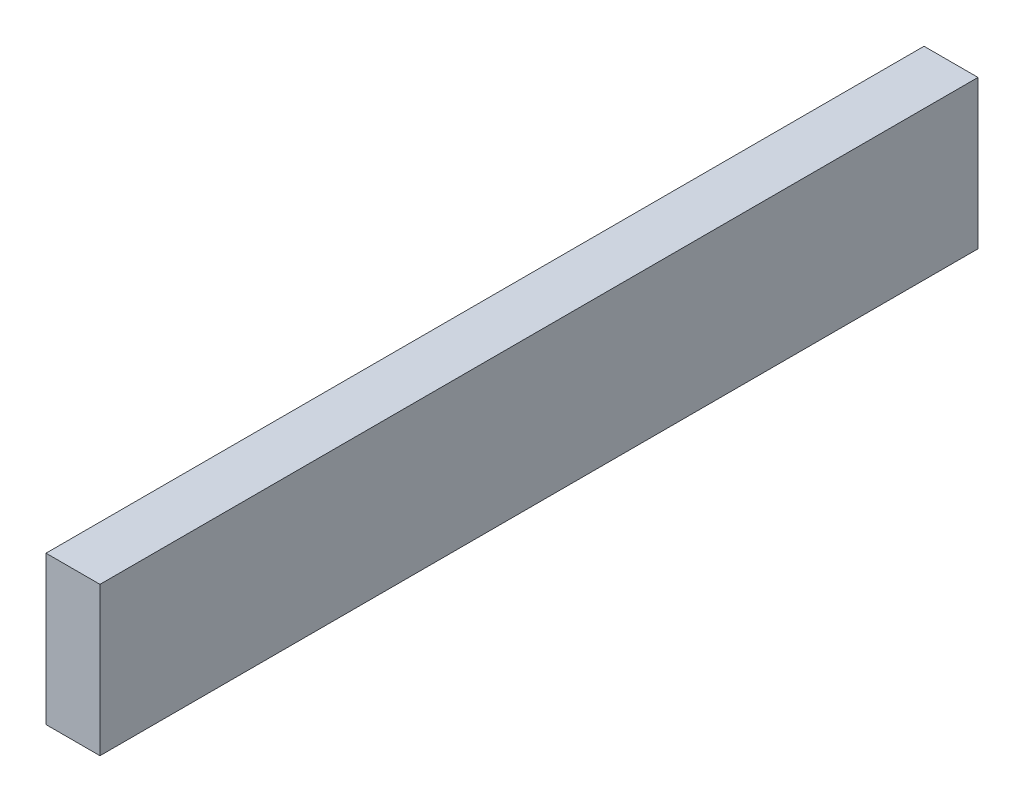
ISO-10303-21;
HEADER;
FILE_DESCRIPTION(('STEP AP214'),'2;1');
FILE_NAME('part.step','',(''),(''),'','','');
FILE_SCHEMA(('AUTOMOTIVE_DESIGN { 1 0 10303 214 1 1 1 1 }'));
ENDSEC;
DATA;
#1=APPLICATION_CONTEXT('core data for automotive mechanical design processes');
#2=APPLICATION_PROTOCOL_DEFINITION('international standard','automotive_design',2000,#1);
#3=PRODUCT_CONTEXT('',#1,'mechanical');
#4=PRODUCT('Part','Part','',(#3));
#5=PRODUCT_RELATED_PRODUCT_CATEGORY('part','',(#4));
#6=PRODUCT_DEFINITION_FORMATION('','',#4);
#7=PRODUCT_DEFINITION_CONTEXT('part definition',#1,'design');
#8=PRODUCT_DEFINITION('design','',#6,#7);
#9=PRODUCT_DEFINITION_SHAPE('','',#8);
#10=(LENGTH_UNIT() NAMED_UNIT(*) SI_UNIT(.MILLI.,.METRE.));
#11=(NAMED_UNIT(*) PLANE_ANGLE_UNIT() SI_UNIT($,.RADIAN.));
#12=(NAMED_UNIT(*) SI_UNIT($,.STERADIAN.) SOLID_ANGLE_UNIT());
#13=UNCERTAINTY_MEASURE_WITH_UNIT(LENGTH_MEASURE(1.E-05),#10,'distance_accuracy_value','');
#14=(GEOMETRIC_REPRESENTATION_CONTEXT(3) GLOBAL_UNCERTAINTY_ASSIGNED_CONTEXT((#13)) GLOBAL_UNIT_ASSIGNED_CONTEXT((#10,
#11,#12)) REPRESENTATION_CONTEXT('',''));
#15=CARTESIAN_POINT('',(0.,0.,0.));
#16=DIRECTION('',(0.,0.,1.));
#17=DIRECTION('',(1.,0.,0.));
#18=AXIS2_PLACEMENT_3D('',#15,#16,#17);
#19=CARTESIAN_POINT('',(1.4254546527396,0.0173250408436242,0.));
#20=DIRECTION('',(0.,-1.,0.));
#21=DIRECTION('',(1.,0.,0.));
#22=AXIS2_PLACEMENT_3D('',#19,#20,#21);
#23=PLANE('',#22);
#24=DIRECTION('',(1.,0.,0.));
#25=VECTOR('',#24,1.);
#26=CARTESIAN_POINT('',(1.4254546527396,0.0173250408436242,0.));
#27=LINE('',#26,#25);
#28=CARTESIAN_POINT('',(1.4254546527396,0.0173250408436242,0.));
#29=VERTEX_POINT('',#28);
#30=CARTESIAN_POINT('',(1.4316017000509,0.0173250408436242,0.));
#31=VERTEX_POINT('',#30);
#32=EDGE_CURVE('E11',#29,#31,#27,.T.);
#33=ORIENTED_EDGE('',*,*,#32,.T.);
#34=DIRECTION('',(0.,0.,1.));
#35=VECTOR('',#34,1.);
#36=CARTESIAN_POINT('',(1.4316017000509,0.0173250408436242,0.));
#37=LINE('',#36,#35);
#38=CARTESIAN_POINT('',(1.4316017000509,0.0173250408436242,0.1));
#39=VERTEX_POINT('',#38);
#40=EDGE_CURVE('E24',#31,#39,#37,.T.);
#41=ORIENTED_EDGE('',*,*,#40,.T.);
#42=DIRECTION('',(1.,0.,0.));
#43=VECTOR('',#42,1.);
#44=CARTESIAN_POINT('',(1.4254546527396,0.0173250408436242,0.1));
#45=LINE('',#44,#43);
#46=CARTESIAN_POINT('',(1.4254546527396,0.0173250408436242,0.1));
#47=VERTEX_POINT('',#46);
#48=EDGE_CURVE('E75',#47,#39,#45,.T.);
#49=ORIENTED_EDGE('',*,*,#48,.F.);
#50=DIRECTION('',(0.,0.,1.));
#51=VECTOR('',#50,1.);
#52=CARTESIAN_POINT('',(1.4254546527396,0.0173250408436242,0.));
#53=LINE('',#52,#51);
#54=EDGE_CURVE('E86',#29,#47,#53,.T.);
#55=ORIENTED_EDGE('',*,*,#54,.F.);
#56=EDGE_LOOP('',(#33,#41,#49,#55));
#57=FACE_BOUND('',#56,.T.);
#58=ADVANCED_FACE('F17',(#57),#23,.T.);
#59=CARTESIAN_POINT('',(1.4254546527396,0.0342323188992742,0.));
#60=DIRECTION('',(-1.,0.,0.));
#61=DIRECTION('',(0.,-1.,0.));
#62=AXIS2_PLACEMENT_3D('',#59,#60,#61);
#63=PLANE('',#62);
#64=DIRECTION('',(0.,-1.,0.));
#65=VECTOR('',#64,1.);
#66=CARTESIAN_POINT('',(1.4254546527396,0.0342323188992742,0.));
#67=LINE('',#66,#65);
#68=CARTESIAN_POINT('',(1.4254546527396,0.0342323188992742,0.));
#69=VERTEX_POINT('',#68);
#70=EDGE_CURVE('E83',#69,#29,#67,.T.);
#71=ORIENTED_EDGE('',*,*,#70,.T.);
#72=ORIENTED_EDGE('',*,*,#54,.T.);
#73=DIRECTION('',(0.,-1.,0.));
#74=VECTOR('',#73,1.);
#75=CARTESIAN_POINT('',(1.4254546527396,0.0342323188992742,0.1));
#76=LINE('',#75,#74);
#77=CARTESIAN_POINT('',(1.4254546527396,0.0342323188992742,0.1));
#78=VERTEX_POINT('',#77);
#79=EDGE_CURVE('E81',#78,#47,#76,.T.);
#80=ORIENTED_EDGE('',*,*,#79,.F.);
#81=DIRECTION('',(0.,0.,1.));
#82=VECTOR('',#81,1.);
#83=CARTESIAN_POINT('',(1.4254546527396,0.0342323188992742,0.));
#84=LINE('',#83,#82);
#85=EDGE_CURVE('E61',#69,#78,#84,.T.);
#86=ORIENTED_EDGE('',*,*,#85,.F.);
#87=EDGE_LOOP('',(#71,#72,#80,#86));
#88=FACE_BOUND('',#87,.T.);
#89=ADVANCED_FACE('F91',(#88),#63,.T.);
#90=CARTESIAN_POINT('',(1.4316017000509,0.0342323188992742,0.));
#91=DIRECTION('',(0.,1.,0.));
#92=DIRECTION('',(-1.,0.,0.));
#93=AXIS2_PLACEMENT_3D('',#90,#91,#92);
#94=PLANE('',#93);
#95=DIRECTION('',(-1.,0.,0.));
#96=VECTOR('',#95,1.);
#97=CARTESIAN_POINT('',(1.4316017000509,0.0342323188992742,0.));
#98=LINE('',#97,#96);
#99=CARTESIAN_POINT('',(1.4316017000509,0.0342323188992742,0.));
#100=VERTEX_POINT('',#99);
#101=EDGE_CURVE('E65',#100,#69,#98,.T.);
#102=ORIENTED_EDGE('',*,*,#101,.T.);
#103=ORIENTED_EDGE('',*,*,#85,.T.);
#104=DIRECTION('',(-1.,0.,0.));
#105=VECTOR('',#104,1.);
#106=CARTESIAN_POINT('',(1.4316017000509,0.0342323188992742,0.1));
#107=LINE('',#106,#105);
#108=CARTESIAN_POINT('',(1.4316017000509,0.0342323188992742,0.1));
#109=VERTEX_POINT('',#108);
#110=EDGE_CURVE('E54',#109,#78,#107,.T.);
#111=ORIENTED_EDGE('',*,*,#110,.F.);
#112=DIRECTION('',(0.,0.,1.));
#113=VECTOR('',#112,1.);
#114=CARTESIAN_POINT('',(1.4316017000509,0.0342323188992742,0.));
#115=LINE('',#114,#113);
#116=EDGE_CURVE('E58',#100,#109,#115,.T.);
#117=ORIENTED_EDGE('',*,*,#116,.F.);
#118=EDGE_LOOP('',(#102,#103,#111,#117));
#119=FACE_BOUND('',#118,.T.);
#120=ADVANCED_FACE('F57',(#119),#94,.T.);
#121=CARTESIAN_POINT('',(1.4316017000509,0.0173250408436242,0.));
#122=DIRECTION('',(1.,0.,0.));
#123=DIRECTION('',(0.,1.,0.));
#124=AXIS2_PLACEMENT_3D('',#121,#122,#123);
#125=PLANE('',#124);
#126=DIRECTION('',(0.,1.,0.));
#127=VECTOR('',#126,1.);
#128=CARTESIAN_POINT('',(1.4316017000509,0.0173250408436242,0.));
#129=LINE('',#128,#127);
#130=EDGE_CURVE('E71',#31,#100,#129,.T.);
#131=ORIENTED_EDGE('',*,*,#130,.T.);
#132=ORIENTED_EDGE('',*,*,#116,.T.);
#133=DIRECTION('',(0.,1.,0.));
#134=VECTOR('',#133,1.);
#135=CARTESIAN_POINT('',(1.4316017000509,0.0173250408436242,0.1));
#136=LINE('',#135,#134);
#137=EDGE_CURVE('E70',#39,#109,#136,.T.);
#138=ORIENTED_EDGE('',*,*,#137,.F.);
#139=ORIENTED_EDGE('',*,*,#40,.F.);
#140=EDGE_LOOP('',(#131,#132,#138,#139));
#141=FACE_BOUND('',#140,.T.);
#142=ADVANCED_FACE('F69',(#141),#125,.T.);
#143=CARTESIAN_POINT('',(1.4285281763953,0.0257786798714492,0.1));
#144=DIRECTION('',(0.,0.,1.));
#145=DIRECTION('',(1.,0.,0.));
#146=AXIS2_PLACEMENT_3D('',#143,#144,#145);
#147=PLANE('',#146);
#148=ORIENTED_EDGE('',*,*,#137,.T.);
#149=ORIENTED_EDGE('',*,*,#110,.T.);
#150=ORIENTED_EDGE('',*,*,#79,.T.);
#151=ORIENTED_EDGE('',*,*,#48,.T.);
#152=EDGE_LOOP('',(#148,#149,#150,#151));
#153=FACE_BOUND('',#152,.T.);
#154=ADVANCED_FACE('F74',(#153),#147,.T.);
#155=CARTESIAN_POINT('',(1.4285281763953,0.0257786798714492,0.));
#156=DIRECTION('',(0.,0.,1.));
#157=DIRECTION('',(1.,0.,0.));
#158=AXIS2_PLACEMENT_3D('',#155,#156,#157);
#159=PLANE('',#158);
#160=ORIENTED_EDGE('',*,*,#130,.F.);
#161=ORIENTED_EDGE('',*,*,#32,.F.);
#162=ORIENTED_EDGE('',*,*,#70,.F.);
#163=ORIENTED_EDGE('',*,*,#101,.F.);
#164=EDGE_LOOP('',(#160,#161,#162,#163));
#165=FACE_BOUND('',#164,.T.);
#166=ADVANCED_FACE('F89',(#165),#159,.F.);
#167=CLOSED_SHELL('',(#58,#89,#120,#142,#154,#166));
#168=MANIFOLD_SOLID_BREP('B1',#167);
#169=ADVANCED_BREP_SHAPE_REPRESENTATION('',(#18,#168),#14);
#170=SHAPE_DEFINITION_REPRESENTATION(#9,#169);
ENDSEC;
END-ISO-10303-21;
